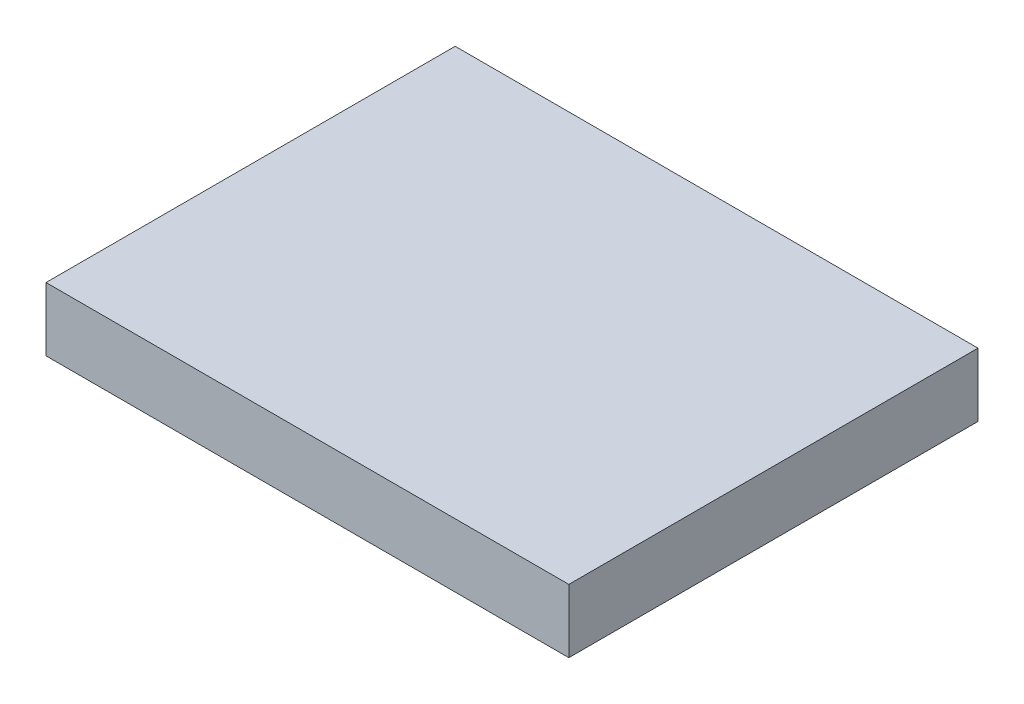
ISO-10303-21;
HEADER;
FILE_DESCRIPTION(('STEP AP214'),'2;1');
FILE_NAME('part.step','',(''),(''),'','','');
FILE_SCHEMA(('AUTOMOTIVE_DESIGN { 1 0 10303 214 1 1 1 1 }'));
ENDSEC;
DATA;
#1=APPLICATION_CONTEXT('core data for automotive mechanical design processes');
#2=APPLICATION_PROTOCOL_DEFINITION('international standard','automotive_design',2000,#1);
#3=PRODUCT_CONTEXT('',#1,'mechanical');
#4=PRODUCT('Part','Part','',(#3));
#5=PRODUCT_RELATED_PRODUCT_CATEGORY('part','',(#4));
#6=PRODUCT_DEFINITION_FORMATION('','',#4);
#7=PRODUCT_DEFINITION_CONTEXT('part definition',#1,'design');
#8=PRODUCT_DEFINITION('design','',#6,#7);
#9=PRODUCT_DEFINITION_SHAPE('','',#8);
#10=(LENGTH_UNIT() NAMED_UNIT(*) SI_UNIT(.MILLI.,.METRE.));
#11=(NAMED_UNIT(*) PLANE_ANGLE_UNIT() SI_UNIT($,.RADIAN.));
#12=(NAMED_UNIT(*) SI_UNIT($,.STERADIAN.) SOLID_ANGLE_UNIT());
#13=UNCERTAINTY_MEASURE_WITH_UNIT(LENGTH_MEASURE(1.E-05),#10,'distance_accuracy_value','');
#14=(GEOMETRIC_REPRESENTATION_CONTEXT(3) GLOBAL_UNCERTAINTY_ASSIGNED_CONTEXT((#13)) GLOBAL_UNIT_ASSIGNED_CONTEXT((#10,
#11,#12)) REPRESENTATION_CONTEXT('',''));
#15=CARTESIAN_POINT('',(0.,0.,0.));
#16=DIRECTION('',(0.,0.,1.));
#17=DIRECTION('',(1.,0.,0.));
#18=AXIS2_PLACEMENT_3D('',#15,#16,#17);
#19=CARTESIAN_POINT('',(34.5,8.382,-27.));
#20=DIRECTION('',(-1.,0.,0.));
#21=DIRECTION('',(0.,0.,1.));
#22=AXIS2_PLACEMENT_3D('',#19,#20,#21);
#23=PLANE('',#22);
#24=DIRECTION('',(0.,0.,-1.));
#25=VECTOR('',#24,1.);
#26=CARTESIAN_POINT('',(34.5,0.,-27.));
#27=LINE('',#26,#25);
#28=CARTESIAN_POINT('',(34.5,0.,27.));
#29=VERTEX_POINT('',#28);
#30=CARTESIAN_POINT('',(34.5,0.,-27.));
#31=VERTEX_POINT('',#30);
#32=EDGE_CURVE('E95',#29,#31,#27,.T.);
#33=ORIENTED_EDGE('',*,*,#32,.T.);
#34=DIRECTION('',(0.,-1.,0.));
#35=VECTOR('',#34,1.);
#36=CARTESIAN_POINT('',(34.5,8.382,-27.));
#37=LINE('',#36,#35);
#38=CARTESIAN_POINT('',(34.5,8.382,-27.));
#39=VERTEX_POINT('',#38);
#40=EDGE_CURVE('E11',#39,#31,#37,.T.);
#41=ORIENTED_EDGE('',*,*,#40,.F.);
#42=DIRECTION('',(0.,0.,-1.));
#43=VECTOR('',#42,1.);
#44=CARTESIAN_POINT('',(34.5,8.382,-27.));
#45=LINE('',#44,#43);
#46=CARTESIAN_POINT('',(34.5,8.382,27.));
#47=VERTEX_POINT('',#46);
#48=EDGE_CURVE('E83',#47,#39,#45,.T.);
#49=ORIENTED_EDGE('',*,*,#48,.F.);
#50=DIRECTION('',(0.,-1.,0.));
#51=VECTOR('',#50,1.);
#52=CARTESIAN_POINT('',(34.5,8.382,27.));
#53=LINE('',#52,#51);
#54=EDGE_CURVE('E91',#47,#29,#53,.T.);
#55=ORIENTED_EDGE('',*,*,#54,.T.);
#56=EDGE_LOOP('',(#33,#41,#49,#55));
#57=FACE_BOUND('',#56,.T.);
#58=ADVANCED_FACE('F32',(#57),#23,.F.);
#59=CARTESIAN_POINT('',(-34.5,8.382,-27.));
#60=DIRECTION('',(0.,0.,1.));
#61=DIRECTION('',(1.,0.,0.));
#62=AXIS2_PLACEMENT_3D('',#59,#60,#61);
#63=PLANE('',#62);
#64=DIRECTION('',(-1.,0.,0.));
#65=VECTOR('',#64,1.);
#66=CARTESIAN_POINT('',(-34.5,0.,-27.));
#67=LINE('',#66,#65);
#68=CARTESIAN_POINT('',(-34.5,0.,-27.));
#69=VERTEX_POINT('',#68);
#70=EDGE_CURVE('E87',#31,#69,#67,.T.);
#71=ORIENTED_EDGE('',*,*,#70,.T.);
#72=DIRECTION('',(0.,-1.,0.));
#73=VECTOR('',#72,1.);
#74=CARTESIAN_POINT('',(-34.5,8.382,-27.));
#75=LINE('',#74,#73);
#76=CARTESIAN_POINT('',(-34.5,8.382,-27.));
#77=VERTEX_POINT('',#76);
#78=EDGE_CURVE('E40',#77,#69,#75,.T.);
#79=ORIENTED_EDGE('',*,*,#78,.F.);
#80=DIRECTION('',(-1.,0.,0.));
#81=VECTOR('',#80,1.);
#82=CARTESIAN_POINT('',(-34.5,8.382,-27.));
#83=LINE('',#82,#81);
#84=EDGE_CURVE('E78',#39,#77,#83,.T.);
#85=ORIENTED_EDGE('',*,*,#84,.F.);
#86=ORIENTED_EDGE('',*,*,#40,.T.);
#87=EDGE_LOOP('',(#71,#79,#85,#86));
#88=FACE_BOUND('',#87,.T.);
#89=ADVANCED_FACE('F86',(#88),#63,.F.);
#90=CARTESIAN_POINT('',(-34.5,8.382,-27.));
#91=DIRECTION('',(1.,0.,0.));
#92=DIRECTION('',(0.,0.,-1.));
#93=AXIS2_PLACEMENT_3D('',#90,#91,#92);
#94=PLANE('',#93);
#95=DIRECTION('',(0.,0.,1.));
#96=VECTOR('',#95,1.);
#97=CARTESIAN_POINT('',(-34.5,0.,-27.));
#98=LINE('',#97,#96);
#99=CARTESIAN_POINT('',(-34.5,0.,27.));
#100=VERTEX_POINT('',#99);
#101=EDGE_CURVE('E65',#69,#100,#98,.T.);
#102=ORIENTED_EDGE('',*,*,#101,.T.);
#103=DIRECTION('',(0.,-1.,0.));
#104=VECTOR('',#103,1.);
#105=CARTESIAN_POINT('',(-34.5,8.382,27.));
#106=LINE('',#105,#104);
#107=CARTESIAN_POINT('',(-34.5,8.382,27.));
#108=VERTEX_POINT('',#107);
#109=EDGE_CURVE('E88',#108,#100,#106,.T.);
#110=ORIENTED_EDGE('',*,*,#109,.F.);
#111=DIRECTION('',(0.,0.,1.));
#112=VECTOR('',#111,1.);
#113=CARTESIAN_POINT('',(-34.5,8.382,-27.));
#114=LINE('',#113,#112);
#115=EDGE_CURVE('E81',#77,#108,#114,.T.);
#116=ORIENTED_EDGE('',*,*,#115,.F.);
#117=ORIENTED_EDGE('',*,*,#78,.T.);
#118=EDGE_LOOP('',(#102,#110,#116,#117));
#119=FACE_BOUND('',#118,.T.);
#120=ADVANCED_FACE('F89',(#119),#94,.F.);
#121=CARTESIAN_POINT('',(-34.5,8.382,27.));
#122=DIRECTION('',(0.,0.,-1.));
#123=DIRECTION('',(-1.,0.,0.));
#124=AXIS2_PLACEMENT_3D('',#121,#122,#123);
#125=PLANE('',#124);
#126=DIRECTION('',(1.,0.,0.));
#127=VECTOR('',#126,1.);
#128=CARTESIAN_POINT('',(-34.5,0.,27.));
#129=LINE('',#128,#127);
#130=EDGE_CURVE('E71',#100,#29,#129,.T.);
#131=ORIENTED_EDGE('',*,*,#130,.T.);
#132=ORIENTED_EDGE('',*,*,#54,.F.);
#133=DIRECTION('',(1.,0.,0.));
#134=VECTOR('',#133,1.);
#135=CARTESIAN_POINT('',(-34.5,8.382,27.));
#136=LINE('',#135,#134);
#137=EDGE_CURVE('E48',#108,#47,#136,.T.);
#138=ORIENTED_EDGE('',*,*,#137,.F.);
#139=ORIENTED_EDGE('',*,*,#109,.T.);
#140=EDGE_LOOP('',(#131,#132,#138,#139));
#141=FACE_BOUND('',#140,.T.);
#142=ADVANCED_FACE('F102',(#141),#125,.F.);
#143=CARTESIAN_POINT('',(0.,8.382,0.));
#144=DIRECTION('',(0.,1.,0.));
#145=DIRECTION('',(0.,0.,1.));
#146=AXIS2_PLACEMENT_3D('',#143,#144,#145);
#147=PLANE('',#146);
#148=ORIENTED_EDGE('',*,*,#48,.T.);
#149=ORIENTED_EDGE('',*,*,#84,.T.);
#150=ORIENTED_EDGE('',*,*,#115,.T.);
#151=ORIENTED_EDGE('',*,*,#137,.T.);
#152=EDGE_LOOP('',(#148,#149,#150,#151));
#153=FACE_BOUND('',#152,.T.);
#154=ADVANCED_FACE('F79',(#153),#147,.T.);
#155=CARTESIAN_POINT('',(0.,0.,0.));
#156=DIRECTION('',(0.,1.,0.));
#157=DIRECTION('',(0.,0.,1.));
#158=AXIS2_PLACEMENT_3D('',#155,#156,#157);
#159=PLANE('',#158);
#160=ORIENTED_EDGE('',*,*,#32,.F.);
#161=ORIENTED_EDGE('',*,*,#130,.F.);
#162=ORIENTED_EDGE('',*,*,#101,.F.);
#163=ORIENTED_EDGE('',*,*,#70,.F.);
#164=EDGE_LOOP('',(#160,#161,#162,#163));
#165=FACE_BOUND('',#164,.T.);
#166=ADVANCED_FACE('F105',(#165),#159,.F.);
#167=CLOSED_SHELL('',(#58,#89,#120,#142,#154,#166));
#168=MANIFOLD_SOLID_BREP('B2',#167);
#169=ADVANCED_BREP_SHAPE_REPRESENTATION('',(#18,#168),#14);
#170=SHAPE_DEFINITION_REPRESENTATION(#9,#169);
ENDSEC;
END-ISO-10303-21;
